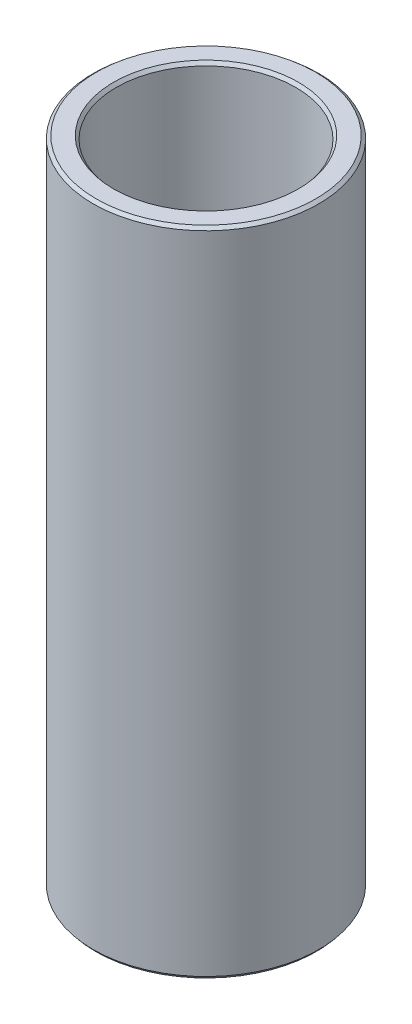
ISO-10303-21;
HEADER;
FILE_DESCRIPTION(('STEP AP214'),'2;1');
FILE_NAME('part.step','',(''),(''),'','','');
FILE_SCHEMA(('AUTOMOTIVE_DESIGN { 1 0 10303 214 1 1 1 1 }'));
ENDSEC;
DATA;
#1=APPLICATION_CONTEXT('core data for automotive mechanical design processes');
#2=APPLICATION_PROTOCOL_DEFINITION('international standard','automotive_design',2000,#1);
#3=PRODUCT_CONTEXT('',#1,'mechanical');
#4=PRODUCT('Part','Part','',(#3));
#5=PRODUCT_RELATED_PRODUCT_CATEGORY('part','',(#4));
#6=PRODUCT_DEFINITION_FORMATION('','',#4);
#7=PRODUCT_DEFINITION_CONTEXT('part definition',#1,'design');
#8=PRODUCT_DEFINITION('design','',#6,#7);
#9=PRODUCT_DEFINITION_SHAPE('','',#8);
#10=(LENGTH_UNIT() NAMED_UNIT(*) SI_UNIT(.MILLI.,.METRE.));
#11=(NAMED_UNIT(*) PLANE_ANGLE_UNIT() SI_UNIT($,.RADIAN.));
#12=(NAMED_UNIT(*) SI_UNIT($,.STERADIAN.) SOLID_ANGLE_UNIT());
#13=UNCERTAINTY_MEASURE_WITH_UNIT(LENGTH_MEASURE(1.E-05),#10,'distance_accuracy_value','');
#14=(GEOMETRIC_REPRESENTATION_CONTEXT(3) GLOBAL_UNCERTAINTY_ASSIGNED_CONTEXT((#13)) GLOBAL_UNIT_ASSIGNED_CONTEXT((#10,
#11,#12)) REPRESENTATION_CONTEXT('',''));
#15=CARTESIAN_POINT('',(0.,0.,0.));
#16=DIRECTION('',(0.,0.,1.));
#17=DIRECTION('',(1.,0.,0.));
#18=AXIS2_PLACEMENT_3D('',#15,#16,#17);
#19=CARTESIAN_POINT('',(0.,331.847616251426,0.));
#20=DIRECTION('',(0.,-1.,0.));
#21=DIRECTION('',(0.,0.,-1.));
#22=AXIS2_PLACEMENT_3D('',#19,#20,#21);
#23=CYLINDRICAL_SURFACE('',#22,57.5);
#24=CARTESIAN_POINT('',(0.,1.61250563823534,0.));
#25=DIRECTION('',(0.,1.,0.));
#26=DIRECTION('',(0.,0.,1.));
#27=AXIS2_PLACEMENT_3D('',#24,#25,#26);
#28=CIRCLE('',#27,57.5);
#29=CARTESIAN_POINT('',(0.,1.61250563823534,57.5));
#30=VERTEX_POINT('',#29);
#31=EDGE_CURVE('E10',#30,#30,#28,.T.);
#32=ORIENTED_EDGE('',*,*,#31,.T.);
#33=EDGE_LOOP('',(#32));
#34=FACE_BOUND('',#33,.T.);
#35=CARTESIAN_POINT('',(0.,330.498166053528,0.));
#36=DIRECTION('',(0.,1.,0.));
#37=DIRECTION('',(0.,0.,1.));
#38=AXIS2_PLACEMENT_3D('',#35,#36,#37);
#39=CIRCLE('',#38,57.5);
#40=CARTESIAN_POINT('',(0.,330.498166053528,57.5));
#41=VERTEX_POINT('',#40);
#42=EDGE_CURVE('E50',#41,#41,#39,.F.);
#43=ORIENTED_EDGE('',*,*,#42,.T.);
#44=EDGE_LOOP('',(#43));
#45=FACE_BOUND('',#44,.T.);
#46=ADVANCED_FACE('F39',(#34,#45),#23,.T.);
#47=CARTESIAN_POINT('',(0.,331.847616251426,0.));
#48=DIRECTION('',(0.,1.,0.));
#49=DIRECTION('',(0.,0.,1.));
#50=AXIS2_PLACEMENT_3D('',#47,#48,#49);
#51=PLANE('',#50);
#52=CARTESIAN_POINT('',(0.,331.847616251426,0.));
#53=DIRECTION('',(0.,1.,0.));
#54=DIRECTION('',(0.,0.,1.));
#55=AXIS2_PLACEMENT_3D('',#52,#53,#54);
#56=CIRCLE('',#55,47.0867501028459);
#57=CARTESIAN_POINT('',(0.,331.847616251426,47.0867501028459));
#58=VERTEX_POINT('',#57);
#59=EDGE_CURVE('E58',#58,#58,#56,.F.);
#60=ORIENTED_EDGE('',*,*,#59,.T.);
#61=EDGE_LOOP('',(#60));
#62=FACE_BOUND('',#61,.T.);
#63=CARTESIAN_POINT('',(0.,331.847616251426,0.));
#64=DIRECTION('',(0.,1.,0.));
#65=DIRECTION('',(0.,0.,1.));
#66=AXIS2_PLACEMENT_3D('',#63,#64,#65);
#67=CIRCLE('',#66,55.8874943617647);
#68=CARTESIAN_POINT('',(0.,331.847616251426,55.8874943617647));
#69=VERTEX_POINT('',#68);
#70=EDGE_CURVE('E61',#69,#69,#67,.T.);
#71=ORIENTED_EDGE('',*,*,#70,.T.);
#72=EDGE_LOOP('',(#71));
#73=FACE_BOUND('',#72,.T.);
#74=ADVANCED_FACE('F88',(#62,#73),#51,.T.);
#75=CARTESIAN_POINT('',(0.,0.,0.));
#76=DIRECTION('',(0.,1.,0.));
#77=DIRECTION('',(0.,0.,1.));
#78=AXIS2_PLACEMENT_3D('',#75,#76,#77);
#79=PLANE('',#78);
#80=CARTESIAN_POINT('',(0.,0.,0.));
#81=DIRECTION('',(0.,1.,0.));
#82=DIRECTION('',(0.,0.,1.));
#83=AXIS2_PLACEMENT_3D('',#80,#81,#82);
#84=CIRCLE('',#83,47.3498055431838);
#85=CARTESIAN_POINT('',(0.,0.,-47.3498055431838));
#86=VERTEX_POINT('',#85);
#87=EDGE_CURVE('E51',#86,#86,#84,.T.);
#88=ORIENTED_EDGE('',*,*,#87,.T.);
#89=EDGE_LOOP('',(#88));
#90=FACE_BOUND('',#89,.T.);
#91=CARTESIAN_POINT('',(0.,0.,0.));
#92=DIRECTION('',(0.,1.,0.));
#93=DIRECTION('',(0.,0.,1.));
#94=AXIS2_PLACEMENT_3D('',#91,#92,#93);
#95=CIRCLE('',#94,56.1505498021026);
#96=CARTESIAN_POINT('',(0.,0.,56.1505498021026));
#97=VERTEX_POINT('',#96);
#98=EDGE_CURVE('E54',#97,#97,#95,.F.);
#99=ORIENTED_EDGE('',*,*,#98,.T.);
#100=EDGE_LOOP('',(#99));
#101=FACE_BOUND('',#100,.T.);
#102=ADVANCED_FACE('F83',(#90,#101),#79,.F.);
#103=CARTESIAN_POINT('',(0.,331.847616251426,0.));
#104=DIRECTION('',(0.,-1.,0.));
#105=DIRECTION('',(0.,0.,-1.));
#106=AXIS2_PLACEMENT_3D('',#103,#104,#105);
#107=CYLINDRICAL_SURFACE('',#106,45.7372999049484);
#108=CARTESIAN_POINT('',(0.,330.23511061319,0.));
#109=DIRECTION('',(0.,1.,0.));
#110=DIRECTION('',(0.,0.,1.));
#111=AXIS2_PLACEMENT_3D('',#108,#109,#110);
#112=CIRCLE('',#111,45.7372999049484);
#113=CARTESIAN_POINT('',(0.,330.23511061319,45.7372999049484));
#114=VERTEX_POINT('',#113);
#115=EDGE_CURVE('E67',#114,#114,#112,.T.);
#116=ORIENTED_EDGE('',*,*,#115,.T.);
#117=EDGE_LOOP('',(#116));
#118=FACE_BOUND('',#117,.T.);
#119=CARTESIAN_POINT('',(0.,1.34945019789739,0.));
#120=DIRECTION('',(0.,1.,0.));
#121=DIRECTION('',(0.,0.,1.));
#122=AXIS2_PLACEMENT_3D('',#119,#120,#121);
#123=CIRCLE('',#122,45.7372999049484);
#124=CARTESIAN_POINT('',(0.,1.34945019789739,-45.7372999049484));
#125=VERTEX_POINT('',#124);
#126=EDGE_CURVE('E69',#125,#125,#123,.F.);
#127=ORIENTED_EDGE('',*,*,#126,.T.);
#128=EDGE_LOOP('',(#127));
#129=FACE_BOUND('',#128,.T.);
#130=ADVANCED_FACE('F71',(#118,#129),#107,.F.);
#131=CARTESIAN_POINT('',(0.,330.23511061319,0.));
#132=DIRECTION('',(0.,1.,0.));
#133=DIRECTION('',(0.,0.,1.));
#134=AXIS2_PLACEMENT_3D('',#131,#132,#133);
#135=CONICAL_SURFACE('',#134,45.7372999049484,0.696819164895224);
#136=ORIENTED_EDGE('',*,*,#59,.F.);
#137=EDGE_LOOP('',(#136));
#138=FACE_BOUND('',#137,.T.);
#139=ORIENTED_EDGE('',*,*,#115,.F.);
#140=EDGE_LOOP('',(#139));
#141=FACE_BOUND('',#140,.T.);
#142=ADVANCED_FACE('F77',(#138,#141),#135,.F.);
#143=CARTESIAN_POINT('',(0.,0.,0.));
#144=DIRECTION('',(0.,-1.,0.));
#145=DIRECTION('',(0.,0.,-1.));
#146=AXIS2_PLACEMENT_3D('',#143,#144,#145);
#147=CONICAL_SURFACE('',#146,47.3498055431838,0.873977161899672);
#148=CARTESIAN_POINT('',(0.,1.34945019789739,-45.7372999049484));
#149=CARTESIAN_POINT('',(0.,1.33539342500263,-45.75409683868));
#150=CARTESIAN_POINT('',(0.,1.32133665210786,-45.7708937724117));
#151=CARTESIAN_POINT('',(0.,1.29322310631834,-45.8044876398749));
#152=CARTESIAN_POINT('',(0.,1.27916633342357,-45.8212845736065));
#153=CARTESIAN_POINT('',(0.,1.25105278763404,-45.8548784410698));
#154=CARTESIAN_POINT('',(0.,1.23699601473928,-45.8716753748014));
#155=CARTESIAN_POINT('',(0.,1.20888246894975,-45.9052692422646));
#156=CARTESIAN_POINT('',(0.,1.19482569605499,-45.9220661759962));
#157=CARTESIAN_POINT('',(0.,1.16671215026546,-45.9556600434595));
#158=CARTESIAN_POINT('',(0.,1.15265537737069,-45.9724569771911));
#159=CARTESIAN_POINT('',(0.,1.12454183158116,-46.0060508446543));
#160=CARTESIAN_POINT('',(0.,1.1104850586864,-46.0228477783859));
#161=CARTESIAN_POINT('',(0.,1.08237151289687,-46.0564416458492));
#162=CARTESIAN_POINT('',(0.,1.0683147400021,-46.0732385795808));
#163=CARTESIAN_POINT('',(0.,1.04020119421257,-46.106832447044));
#164=CARTESIAN_POINT('',(0.,1.02614442131781,-46.1236293807757));
#165=CARTESIAN_POINT('',(0.,0.998030875528282,-46.1572232482389));
#166=CARTESIAN_POINT('',(0.,0.983974102633516,-46.1740201819705));
#167=CARTESIAN_POINT('',(0.,0.955860556843988,-46.2076140494337));
#168=CARTESIAN_POINT('',(0.,0.941803783949224,-46.2244109831654));
#169=CARTESIAN_POINT('',(0.,0.913690238159695,-46.2580048506286));
#170=CARTESIAN_POINT('',(0.,0.899633465264929,-46.2748017843602));
#171=CARTESIAN_POINT('',(0.,0.8715199194754,-46.3083956518235));
#172=CARTESIAN_POINT('',(0.,0.857463146580637,-46.3251925855551));
#173=CARTESIAN_POINT('',(0.,0.829349600791108,-46.3587864530183));
#174=CARTESIAN_POINT('',(0.,0.815292827896342,-46.3755833867499));
#175=CARTESIAN_POINT('',(0.,0.787179282106813,-46.4091772542132));
#176=CARTESIAN_POINT('',(0.,0.773122509212049,-46.4259741879448));
#177=CARTESIAN_POINT('',(0.,0.745008963422521,-46.459568055408));
#178=CARTESIAN_POINT('',(0.,0.730952190527756,-46.4763649891396));
#179=CARTESIAN_POINT('',(0.,0.702838644738226,-46.5099588566029));
#180=CARTESIAN_POINT('',(0.,0.688781871843461,-46.5267557903345));
#181=CARTESIAN_POINT('',(0.,0.660668326053933,-46.5603496577977));
#182=CARTESIAN_POINT('',(0.,0.646611553159169,-46.5771465915293));
#183=CARTESIAN_POINT('',(0.,0.61849800736964,-46.6107404589926));
#184=CARTESIAN_POINT('',(0.,0.604441234474874,-46.6275373927242));
#185=CARTESIAN_POINT('',(0.,0.576327688685345,-46.6611312601874));
#186=CARTESIAN_POINT('',(0.,0.562270915790582,-46.6779281939191));
#187=CARTESIAN_POINT('',(0.,0.534157370001053,-46.7115220613823));
#188=CARTESIAN_POINT('',(0.,0.520100597106287,-46.7283189951139));
#189=CARTESIAN_POINT('',(0.,0.491987051316758,-46.7619128625771));
#190=CARTESIAN_POINT('',(0.,0.477930278421995,-46.7787097963088));
#191=CARTESIAN_POINT('',(0.,0.449816732632466,-46.812303663772));
#192=CARTESIAN_POINT('',(0.,0.4357599597377,-46.8291005975036));
#193=CARTESIAN_POINT('',(0.,0.407646413948171,-46.8626944649668));
#194=CARTESIAN_POINT('',(0.,0.393589641053407,-46.8794913986985));
#195=CARTESIAN_POINT('',(0.,0.365476095263878,-46.9130852661617));
#196=CARTESIAN_POINT('',(0.,0.351419322369113,-46.9298821998933));
#197=CARTESIAN_POINT('',(0.,0.323305776579584,-46.9634760673566));
#198=CARTESIAN_POINT('',(0.,0.30924900368482,-46.9802730010882));
#199=CARTESIAN_POINT('',(0.,0.281135457895291,-47.0138668685514));
#200=CARTESIAN_POINT('',(0.,0.267078685000525,-47.030663802283));
#201=CARTESIAN_POINT('',(0.,0.238965139210996,-47.0642576697463));
#202=CARTESIAN_POINT('',(0.,0.224908366316233,-47.0810546034779));
#203=CARTESIAN_POINT('',(0.,0.196794820526704,-47.1146484709411));
#204=CARTESIAN_POINT('',(0.,0.182738047631938,-47.1314454046727));
#205=CARTESIAN_POINT('',(0.,0.154624501842409,-47.165039272136));
#206=CARTESIAN_POINT('',(0.,0.140567728947646,-47.1818362058676));
#207=CARTESIAN_POINT('',(0.,0.112454183158117,-47.2154300733308));
#208=CARTESIAN_POINT('',(0.,0.0983974102633513,-47.2322270070624));
#209=CARTESIAN_POINT('',(0.,0.0702838644738219,-47.2658208745257));
#210=CARTESIAN_POINT('',(0.,0.056227091579058,-47.2826178082573));
#211=CARTESIAN_POINT('',(0.,0.0281135457895303,-47.3162116757205));
#212=CARTESIAN_POINT('',(0.,0.0140567728947664,-47.3330086094522));
#213=CARTESIAN_POINT('',(0.,0.,-47.3498055431838));
#214=B_SPLINE_CURVE_WITH_KNOTS('',3,(#148,#149,#150,#151,#152,#153,#154,#155,#156,#157,#158,
#159,#160,#161,#162,#163,#164,#165,#166,#167,#168,#169,#170,#171,#172,#173,#174,#175,#176,#177,
#178,#179,#180,#181,#182,#183,#184,#185,#186,#187,#188,#189,#190,#191,#192,#193,#194,#195,#196,
#197,#198,#199,#200,#201,#202,#203,#204,#205,#206,#207,#208,#209,#210,#211,#212,#213),
.UNSPECIFIED.,.F.,.F.,(4,2,2,2,2,2,2,2,2,2,2,2,2,2,2,2,2,2,2,2,2,2,2,2,2,2,2,2,2,2,2,2,4),(0.,
0.0657082081858413,0.131416416371688,0.197124624557529,0.262832832743376,0.328541040929217,
0.394249249115064,0.459957457300905,0.525665665486752,0.591373873672593,0.65708208185844,
0.722790290044281,0.788498498230128,0.854206706415969,0.919914914601816,0.985623122787657,
1.0513313309735,1.11703953915935,1.18274774734519,1.24845595553103,1.31416416371688,
1.37987237190272,1.44558058008856,1.51128878827441,1.57699699646025,1.6427052046461,
1.70841341283194,1.77412162101779,1.83982982920363,1.90553803738947,1.97124624557532,
2.03695445376116,2.102662661947),.UNSPECIFIED.);
#215=EDGE_CURVE('BSEAM73',#125,#86,#214,.T.);
#216=ORIENTED_EDGE('',*,*,#126,.F.);
#217=ORIENTED_EDGE('',*,*,#87,.F.);
#218=ORIENTED_EDGE('',*,*,#215,.T.);
#219=ORIENTED_EDGE('',*,*,#215,.F.);
#220=EDGE_LOOP('',(#216,#218,#217,#219));
#221=FACE_BOUND('',#220,.T.);
#222=ADVANCED_FACE('F73',(#221),#147,.F.);
#223=CARTESIAN_POINT('',(0.,1.61250563823534,0.));
#224=DIRECTION('',(0.,1.,0.));
#225=DIRECTION('',(0.,0.,1.));
#226=AXIS2_PLACEMENT_3D('',#223,#224,#225);
#227=CONICAL_SURFACE('',#226,57.5,0.696819164895215);
#228=ORIENTED_EDGE('',*,*,#98,.F.);
#229=EDGE_LOOP('',(#228));
#230=FACE_BOUND('',#229,.T.);
#231=ORIENTED_EDGE('',*,*,#31,.F.);
#232=EDGE_LOOP('',(#231));
#233=FACE_BOUND('',#232,.T.);
#234=ADVANCED_FACE('F76',(#230,#233),#227,.T.);
#235=CARTESIAN_POINT('',(0.,331.847616251426,0.));
#236=DIRECTION('',(0.,-1.,0.));
#237=DIRECTION('',(0.,0.,-1.));
#238=AXIS2_PLACEMENT_3D('',#235,#236,#237);
#239=CONICAL_SURFACE('',#238,55.8874943617647,0.873977161899677);
#240=ORIENTED_EDGE('',*,*,#42,.F.);
#241=EDGE_LOOP('',(#240));
#242=FACE_BOUND('',#241,.T.);
#243=ORIENTED_EDGE('',*,*,#70,.F.);
#244=EDGE_LOOP('',(#243));
#245=FACE_BOUND('',#244,.T.);
#246=ADVANCED_FACE('F45',(#242,#245),#239,.T.);
#247=CLOSED_SHELL('',(#46,#74,#102,#130,#142,#222,#234,#246));
#248=MANIFOLD_SOLID_BREP('B2',#247);
#249=ADVANCED_BREP_SHAPE_REPRESENTATION('',(#18,#248),#14);
#250=SHAPE_DEFINITION_REPRESENTATION(#9,#249);
ENDSEC;
END-ISO-10303-21;
